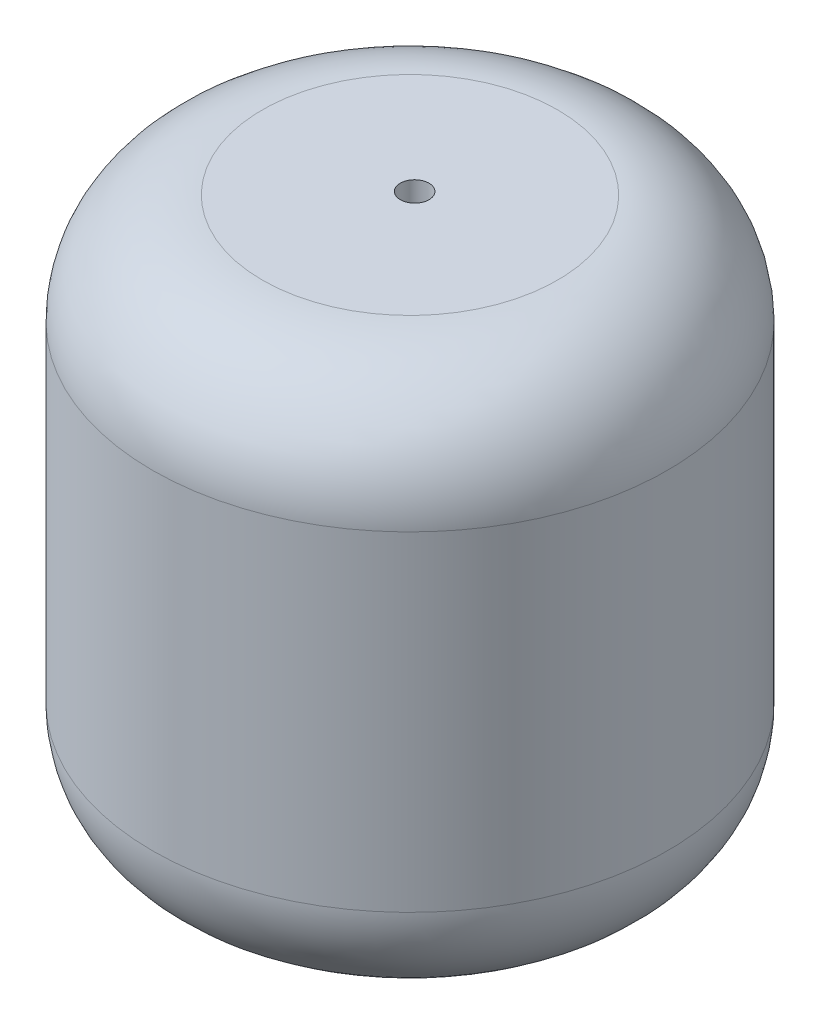
ISO-10303-21;
HEADER;
FILE_DESCRIPTION(('STEP AP214'),'2;1');
FILE_NAME('part.step','',(''),(''),'','','');
FILE_SCHEMA(('AUTOMOTIVE_DESIGN { 1 0 10303 214 1 1 1 1 }'));
ENDSEC;
DATA;
#1=APPLICATION_CONTEXT('core data for automotive mechanical design processes');
#2=APPLICATION_PROTOCOL_DEFINITION('international standard','automotive_design',2000,#1);
#3=PRODUCT_CONTEXT('',#1,'mechanical');
#4=PRODUCT('Part','Part','',(#3));
#5=PRODUCT_RELATED_PRODUCT_CATEGORY('part','',(#4));
#6=PRODUCT_DEFINITION_FORMATION('','',#4);
#7=PRODUCT_DEFINITION_CONTEXT('part definition',#1,'design');
#8=PRODUCT_DEFINITION('design','',#6,#7);
#9=PRODUCT_DEFINITION_SHAPE('','',#8);
#10=(LENGTH_UNIT() NAMED_UNIT(*) SI_UNIT(.MILLI.,.METRE.));
#11=(NAMED_UNIT(*) PLANE_ANGLE_UNIT() SI_UNIT($,.RADIAN.));
#12=(NAMED_UNIT(*) SI_UNIT($,.STERADIAN.) SOLID_ANGLE_UNIT());
#13=UNCERTAINTY_MEASURE_WITH_UNIT(LENGTH_MEASURE(1.E-05),#10,'distance_accuracy_value','');
#14=(GEOMETRIC_REPRESENTATION_CONTEXT(3) GLOBAL_UNCERTAINTY_ASSIGNED_CONTEXT((#13)) GLOBAL_UNIT_ASSIGNED_CONTEXT((#10,
#11,#12)) REPRESENTATION_CONTEXT('',''));
#15=CARTESIAN_POINT('',(0.,0.,0.));
#16=DIRECTION('',(0.,0.,1.));
#17=DIRECTION('',(1.,0.,0.));
#18=AXIS2_PLACEMENT_3D('',#15,#16,#17);
#19=CARTESIAN_POINT('',(-4.8001320025352,25.4,-11.4669820060563));
#20=DIRECTION('',(0.,-1.,0.));
#21=DIRECTION('',(0.,0.,-1.));
#22=AXIS2_PLACEMENT_3D('',#19,#20,#21);
#23=CYLINDRICAL_SURFACE('',#22,11.90625);
#24=CARTESIAN_POINT('',(-4.8001320025352,5.08,-11.4669820060563));
#25=DIRECTION('',(0.,1.,0.));
#26=DIRECTION('',(0.,0.,1.));
#27=AXIS2_PLACEMENT_3D('',#24,#25,#26);
#28=CIRCLE('',#27,11.90625);
#29=CARTESIAN_POINT('',(-4.8001320025352,5.08,0.439267993943677));
#30=VERTEX_POINT('',#29);
#31=EDGE_CURVE('E51',#30,#30,#28,.T.);
#32=ORIENTED_EDGE('',*,*,#31,.T.);
#33=EDGE_LOOP('',(#32));
#34=FACE_BOUND('',#33,.T.);
#35=CARTESIAN_POINT('',(-4.8001320025352,20.32,-11.4669820060563));
#36=DIRECTION('',(0.,1.,0.));
#37=DIRECTION('',(0.,0.,1.));
#38=AXIS2_PLACEMENT_3D('',#35,#36,#37);
#39=CIRCLE('',#38,11.90625);
#40=CARTESIAN_POINT('',(-4.8001320025352,20.32,0.439267993943677));
#41=VERTEX_POINT('',#40);
#42=EDGE_CURVE('E56',#41,#41,#39,.F.);
#43=ORIENTED_EDGE('',*,*,#42,.T.);
#44=EDGE_LOOP('',(#43));
#45=FACE_BOUND('',#44,.T.);
#46=ADVANCED_FACE('F43',(#34,#45),#23,.T.);
#47=CARTESIAN_POINT('',(-4.8001320025352,25.4,-11.4669820060563));
#48=DIRECTION('',(0.,1.,0.));
#49=DIRECTION('',(0.,0.,1.));
#50=AXIS2_PLACEMENT_3D('',#47,#48,#49);
#51=PLANE('',#50);
#52=CARTESIAN_POINT('',(-4.8333401516058,25.4,-11.7160431240859));
#53=DIRECTION('',(0.,1.,0.));
#54=DIRECTION('',(0.,0.,1.));
#55=AXIS2_PLACEMENT_3D('',#52,#53,#54);
#56=CIRCLE('',#55,0.664162981411934);
#57=CARTESIAN_POINT('',(-4.8333401516058,25.4,-11.051880142674));
#58=VERTEX_POINT('',#57);
#59=EDGE_CURVE('E68',#58,#58,#56,.T.);
#60=ORIENTED_EDGE('',*,*,#59,.F.);
#61=EDGE_LOOP('',(#60));
#62=FACE_BOUND('',#61,.T.);
#63=CARTESIAN_POINT('',(-4.8001320025352,25.4,-11.4669820060563));
#64=DIRECTION('',(0.,1.,0.));
#65=DIRECTION('',(0.,0.,1.));
#66=AXIS2_PLACEMENT_3D('',#63,#64,#65);
#67=CIRCLE('',#66,6.82625);
#68=CARTESIAN_POINT('',(-4.8001320025352,25.4,-4.64073200605632));
#69=VERTEX_POINT('',#68);
#70=EDGE_CURVE('E61',#69,#69,#67,.T.);
#71=ORIENTED_EDGE('',*,*,#70,.T.);
#72=EDGE_LOOP('',(#71));
#73=FACE_BOUND('',#72,.T.);
#74=ADVANCED_FACE('F84',(#62,#73),#51,.T.);
#75=CARTESIAN_POINT('',(-4.8001320025352,0.,-11.4669820060563));
#76=DIRECTION('',(0.,1.,0.));
#77=DIRECTION('',(0.,0.,1.));
#78=AXIS2_PLACEMENT_3D('',#75,#76,#77);
#79=PLANE('',#78);
#80=CARTESIAN_POINT('',(-4.8333401516058,0.,-11.7160431240859));
#81=DIRECTION('',(0.,1.,0.));
#82=DIRECTION('',(0.,0.,1.));
#83=AXIS2_PLACEMENT_3D('',#80,#81,#82);
#84=CIRCLE('',#83,0.664162981411934);
#85=CARTESIAN_POINT('',(-4.8333401516058,0.,-11.051880142674));
#86=VERTEX_POINT('',#85);
#87=EDGE_CURVE('E67',#86,#86,#84,.T.);
#88=ORIENTED_EDGE('',*,*,#87,.T.);
#89=EDGE_LOOP('',(#88));
#90=FACE_BOUND('',#89,.T.);
#91=CARTESIAN_POINT('',(-4.8001320025352,0.,-11.4669820060563));
#92=DIRECTION('',(0.,1.,0.));
#93=DIRECTION('',(0.,0.,1.));
#94=AXIS2_PLACEMENT_3D('',#91,#92,#93);
#95=CIRCLE('',#94,6.82625);
#96=CARTESIAN_POINT('',(-4.8001320025352,0.,-4.64073200605632));
#97=VERTEX_POINT('',#96);
#98=EDGE_CURVE('E10',#97,#97,#95,.F.);
#99=ORIENTED_EDGE('',*,*,#98,.T.);
#100=EDGE_LOOP('',(#99));
#101=FACE_BOUND('',#100,.T.);
#102=ADVANCED_FACE('F76',(#90,#101),#79,.F.);
#103=CARTESIAN_POINT('',(-4.8001320025352,20.32,-11.4669820060563));
#104=DIRECTION('',(0.,1.,0.));
#105=DIRECTION('',(0.,0.,1.));
#106=AXIS2_PLACEMENT_3D('',#103,#104,#105);
#107=TOROIDAL_SURFACE('',#106,6.82625,5.08);
#108=ORIENTED_EDGE('',*,*,#42,.F.);
#109=EDGE_LOOP('',(#108));
#110=FACE_BOUND('',#109,.T.);
#111=ORIENTED_EDGE('',*,*,#70,.F.);
#112=EDGE_LOOP('',(#111));
#113=FACE_BOUND('',#112,.T.);
#114=ADVANCED_FACE('F90',(#110,#113),#107,.T.);
#115=CARTESIAN_POINT('',(-4.8001320025352,5.08,-11.4669820060563));
#116=DIRECTION('',(0.,1.,0.));
#117=DIRECTION('',(0.,0.,1.));
#118=AXIS2_PLACEMENT_3D('',#115,#116,#117);
#119=TOROIDAL_SURFACE('',#118,6.82625,5.08);
#120=ORIENTED_EDGE('',*,*,#98,.F.);
#121=EDGE_LOOP('',(#120));
#122=FACE_BOUND('',#121,.T.);
#123=ORIENTED_EDGE('',*,*,#31,.F.);
#124=EDGE_LOOP('',(#123));
#125=FACE_BOUND('',#124,.T.);
#126=ADVANCED_FACE('F45',(#122,#125),#119,.T.);
#127=CARTESIAN_POINT('',(-4.8333401516058,0.,-11.7160431240859));
#128=DIRECTION('',(0.,1.,0.));
#129=DIRECTION('',(0.,0.,1.));
#130=AXIS2_PLACEMENT_3D('',#127,#128,#129);
#131=CYLINDRICAL_SURFACE('',#130,0.664162981411934);
#132=ORIENTED_EDGE('',*,*,#87,.F.);
#133=EDGE_LOOP('',(#132));
#134=FACE_BOUND('',#133,.T.);
#135=ORIENTED_EDGE('',*,*,#59,.T.);
#136=EDGE_LOOP('',(#135));
#137=FACE_BOUND('',#136,.T.);
#138=ADVANCED_FACE('F78',(#134,#137),#131,.F.);
#139=CLOSED_SHELL('',(#46,#74,#102,#114,#126,#138));
#140=MANIFOLD_SOLID_BREP('B2',#139);
#141=ADVANCED_BREP_SHAPE_REPRESENTATION('',(#18,#140),#14);
#142=SHAPE_DEFINITION_REPRESENTATION(#9,#141);
ENDSEC;
END-ISO-10303-21;
